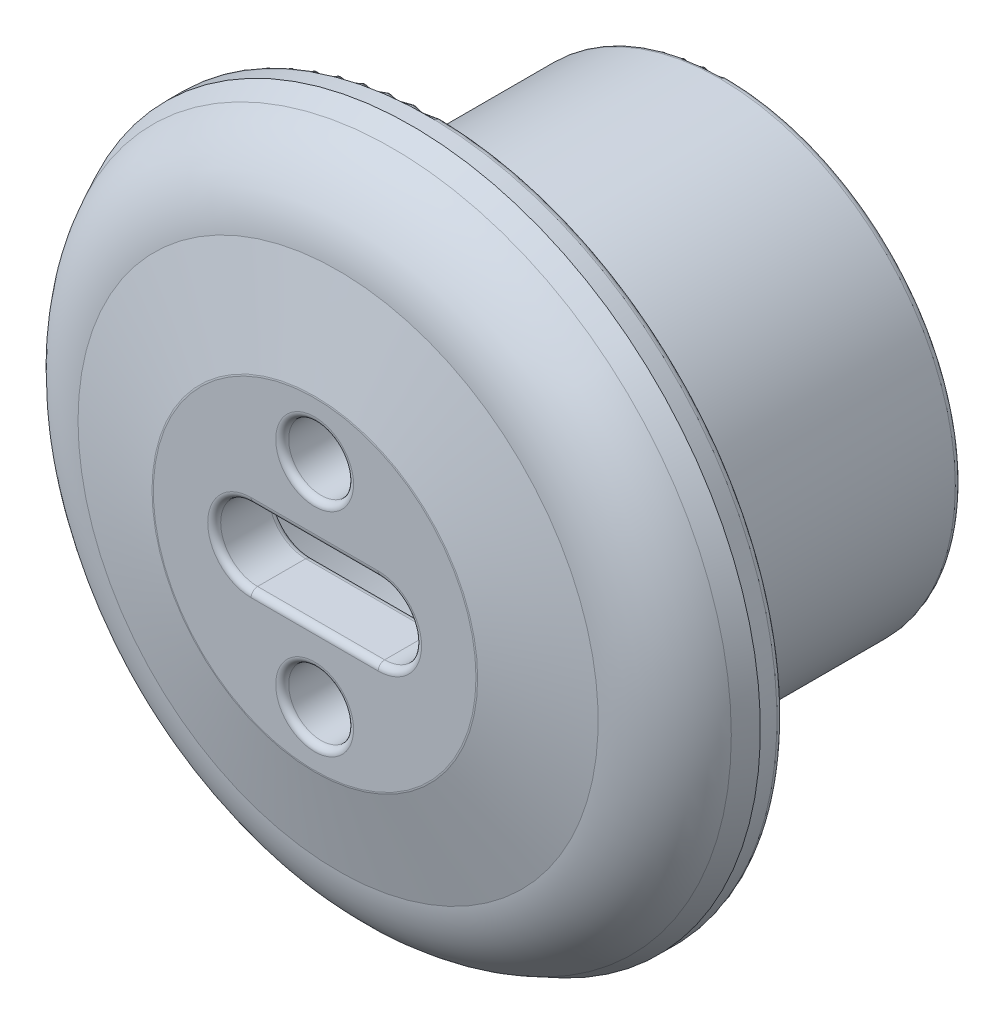
ISO-10303-21;
HEADER;
FILE_DESCRIPTION(('STEP AP214'),'2;1');
FILE_NAME('part.step','',(''),(''),'','','');
FILE_SCHEMA(('AUTOMOTIVE_DESIGN { 1 0 10303 214 1 1 1 1 }'));
ENDSEC;
DATA;
#1=APPLICATION_CONTEXT('core data for automotive mechanical design processes');
#2=APPLICATION_PROTOCOL_DEFINITION('international standard','automotive_design',2000,#1);
#3=PRODUCT_CONTEXT('',#1,'mechanical');
#4=PRODUCT('Part','Part','',(#3));
#5=PRODUCT_RELATED_PRODUCT_CATEGORY('part','',(#4));
#6=PRODUCT_DEFINITION_FORMATION('','',#4);
#7=PRODUCT_DEFINITION_CONTEXT('part definition',#1,'design');
#8=PRODUCT_DEFINITION('design','',#6,#7);
#9=PRODUCT_DEFINITION_SHAPE('','',#8);
#10=(LENGTH_UNIT() NAMED_UNIT(*) SI_UNIT(.MILLI.,.METRE.));
#11=(NAMED_UNIT(*) PLANE_ANGLE_UNIT() SI_UNIT($,.RADIAN.));
#12=(NAMED_UNIT(*) SI_UNIT($,.STERADIAN.) SOLID_ANGLE_UNIT());
#13=UNCERTAINTY_MEASURE_WITH_UNIT(LENGTH_MEASURE(1.E-05),#10,'distance_accuracy_value','');
#14=(GEOMETRIC_REPRESENTATION_CONTEXT(3) GLOBAL_UNCERTAINTY_ASSIGNED_CONTEXT((#13)) GLOBAL_UNIT_ASSIGNED_CONTEXT((#10,
#11,#12)) REPRESENTATION_CONTEXT('',''));
#15=CARTESIAN_POINT('',(0.,0.,0.));
#16=DIRECTION('',(0.,0.,1.));
#17=DIRECTION('',(1.,0.,0.));
#18=AXIS2_PLACEMENT_3D('',#15,#16,#17);
#19=CARTESIAN_POINT('',(0.,0.,0.));
#20=DIRECTION('',(0.,0.,1.));
#21=DIRECTION('',(1.,0.,0.));
#22=AXIS2_PLACEMENT_3D('',#19,#20,#21);
#23=PLANE('',#22);
#24=CARTESIAN_POINT('',(0.,0.,0.));
#25=DIRECTION('',(0.,0.,1.));
#26=DIRECTION('',(1.,0.,0.));
#27=AXIS2_PLACEMENT_3D('',#24,#25,#26);
#28=CIRCLE('',#27,4.97638891235121);
#29=CARTESIAN_POINT('',(4.97638891235121,0.,0.));
#30=VERTEX_POINT('',#29);
#31=EDGE_CURVE('E11',#30,#30,#28,.T.);
#32=ORIENTED_EDGE('',*,*,#31,.T.);
#33=EDGE_LOOP('',(#32));
#34=FACE_BOUND('',#33,.T.);
#35=CARTESIAN_POINT('',(1.95955224461386,0.,0.));
#36=DIRECTION('',(0.,0.,1.));
#37=DIRECTION('',(1.,0.,0.));
#38=AXIS2_PLACEMENT_3D('',#35,#36,#37);
#39=CIRCLE('',#38,1.33824518055594);
#40=CARTESIAN_POINT('',(1.95955224461386,1.33824518055594,0.));
#41=VERTEX_POINT('',#40);
#42=CARTESIAN_POINT('',(1.95955224461386,-1.33824518055594,0.));
#43=VERTEX_POINT('',#42);
#44=EDGE_CURVE('E57',#41,#43,#39,.F.);
#45=ORIENTED_EDGE('',*,*,#44,.T.);
#46=DIRECTION('',(1.,0.,0.));
#47=VECTOR('',#46,1.);
#48=CARTESIAN_POINT('',(-1.95955224461386,-1.33824518055594,0.));
#49=LINE('',#48,#47);
#50=CARTESIAN_POINT('',(-1.95955224461386,-1.33824518055594,0.));
#51=VERTEX_POINT('',#50);
#52=EDGE_CURVE('E49',#43,#51,#49,.F.);
#53=ORIENTED_EDGE('',*,*,#52,.T.);
#54=CARTESIAN_POINT('',(-1.95955224461386,0.,0.));
#55=DIRECTION('',(0.,0.,1.));
#56=DIRECTION('',(1.,0.,0.));
#57=AXIS2_PLACEMENT_3D('',#54,#55,#56);
#58=CIRCLE('',#57,1.33824518055594);
#59=CARTESIAN_POINT('',(-1.95955224461386,1.33824518055594,0.));
#60=VERTEX_POINT('',#59);
#61=EDGE_CURVE('E283',#51,#60,#58,.F.);
#62=ORIENTED_EDGE('',*,*,#61,.T.);
#63=DIRECTION('',(-1.,0.,0.));
#64=VECTOR('',#63,1.);
#65=CARTESIAN_POINT('',(1.95955224461386,1.33824518055594,0.));
#66=LINE('',#65,#64);
#67=EDGE_CURVE('E62',#60,#41,#66,.F.);
#68=ORIENTED_EDGE('',*,*,#67,.T.);
#69=EDGE_LOOP('',(#45,#53,#62,#68));
#70=FACE_BOUND('',#69,.T.);
#71=CARTESIAN_POINT('',(0.,3.27442446554471,0.));
#72=DIRECTION('',(0.,0.,1.));
#73=DIRECTION('',(1.,0.,0.));
#74=AXIS2_PLACEMENT_3D('',#71,#72,#73);
#75=CIRCLE('',#74,1.2);
#76=CARTESIAN_POINT('',(1.2,3.27442446554471,0.));
#77=VERTEX_POINT('',#76);
#78=EDGE_CURVE('E279',#77,#77,#75,.F.);
#79=ORIENTED_EDGE('',*,*,#78,.T.);
#80=EDGE_LOOP('',(#79));
#81=FACE_BOUND('',#80,.T.);
#82=CARTESIAN_POINT('',(0.,-3.27442446554471,0.));
#83=DIRECTION('',(0.,0.,1.));
#84=DIRECTION('',(1.,0.,0.));
#85=AXIS2_PLACEMENT_3D('',#82,#83,#84);
#86=CIRCLE('',#85,1.2);
#87=CARTESIAN_POINT('',(1.2,-3.27442446554471,0.));
#88=VERTEX_POINT('',#87);
#89=EDGE_CURVE('E275',#88,#88,#86,.F.);
#90=ORIENTED_EDGE('',*,*,#89,.T.);
#91=EDGE_LOOP('',(#90));
#92=FACE_BOUND('',#91,.T.);
#93=ADVANCED_FACE('F39',(#34,#70,#81,#92),#23,.T.);
#94=CARTESIAN_POINT('',(0.,0.,-0.723761069473712));
#95=DIRECTION('',(0.,0.,-1.));
#96=DIRECTION('',(-1.,0.,0.));
#97=AXIS2_PLACEMENT_3D('',#94,#95,#96);
#98=CONICAL_SURFACE('',#97,8.02262208103095,1.33577326733021);
#99=CARTESIAN_POINT('',(0.,0.,-0.00549820563210427));
#100=DIRECTION('',(0.,0.,1.));
#101=DIRECTION('',(1.,0.,0.));
#102=AXIS2_PLACEMENT_3D('',#99,#100,#101);
#103=CIRCLE('',#102,5.02296199457334);
#104=CARTESIAN_POINT('',(5.02296199457334,0.,-0.00549820563210427));
#105=VERTEX_POINT('',#104);
#106=EDGE_CURVE('E271',#105,#105,#103,.F.);
#107=ORIENTED_EDGE('',*,*,#106,.T.);
#108=EDGE_LOOP('',(#107));
#109=FACE_BOUND('',#108,.T.);
#110=CARTESIAN_POINT('',(0.,0.,-0.723761069473712));
#111=DIRECTION('',(0.,0.,-1.));
#112=DIRECTION('',(-1.,0.,0.));
#113=AXIS2_PLACEMENT_3D('',#110,#111,#112);
#114=CIRCLE('',#113,8.02262208103095);
#115=CARTESIAN_POINT('',(-8.02262208103095,0.,-0.723761069473712));
#116=VERTEX_POINT('',#115);
#117=EDGE_CURVE('E185',#116,#116,#114,.T.);
#118=ORIENTED_EDGE('',*,*,#117,.F.);
#119=EDGE_LOOP('',(#118));
#120=FACE_BOUND('',#119,.T.);
#121=ADVANCED_FACE('F325',(#109,#120),#98,.T.);
#122=CARTESIAN_POINT('',(0.,0.,-3.7122066964541));
#123=DIRECTION('',(0.,0.,-1.));
#124=DIRECTION('',(-1.,0.,0.));
#125=AXIS2_PLACEMENT_3D('',#122,#123,#124);
#126=TOROIDAL_SURFACE('',#125,7.7595769621221,3.);
#127=ORIENTED_EDGE('',*,*,#117,.T.);
#128=EDGE_LOOP('',(#127));
#129=FACE_BOUND('',#128,.T.);
#130=CARTESIAN_POINT('',(0.,0.,-2.39715239491272));
#131=DIRECTION('',(0.,0.,-1.));
#132=DIRECTION('',(-1.,0.,0.));
#133=AXIS2_PLACEMENT_3D('',#130,#131,#132);
#134=CIRCLE('',#133,10.4559879441494);
#135=CARTESIAN_POINT('',(-10.4559879441494,0.,-2.39715239491272));
#136=VERTEX_POINT('',#135);
#137=EDGE_CURVE('E181',#136,#136,#134,.T.);
#138=ORIENTED_EDGE('',*,*,#137,.F.);
#139=EDGE_LOOP('',(#138));
#140=FACE_BOUND('',#139,.T.);
#141=ADVANCED_FACE('F406',(#129,#140),#126,.T.);
#142=CARTESIAN_POINT('',(0.,0.,-3.));
#143=DIRECTION('',(0.,0.,-1.));
#144=DIRECTION('',(-1.,0.,0.));
#145=AXIS2_PLACEMENT_3D('',#142,#143,#144);
#146=CONICAL_SURFACE('',#145,10.75,0.453763672978369);
#147=ORIENTED_EDGE('',*,*,#137,.T.);
#148=EDGE_LOOP('',(#147));
#149=FACE_BOUND('',#148,.T.);
#150=CARTESIAN_POINT('',(0.,0.,-3.));
#151=DIRECTION('',(0.,0.,-1.));
#152=DIRECTION('',(-1.,0.,0.));
#153=AXIS2_PLACEMENT_3D('',#150,#151,#152);
#154=CIRCLE('',#153,10.75);
#155=CARTESIAN_POINT('',(-10.75,0.,-3.));
#156=VERTEX_POINT('',#155);
#157=EDGE_CURVE('E177',#156,#156,#154,.T.);
#158=ORIENTED_EDGE('',*,*,#157,.F.);
#159=EDGE_LOOP('',(#158));
#160=FACE_BOUND('',#159,.T.);
#161=ADVANCED_FACE('F402',(#149,#160),#146,.T.);
#162=CARTESIAN_POINT('',(0.,0.,-1.88250995795869));
#163=DIRECTION('',(0.,0.,-1.));
#164=DIRECTION('',(-1.,0.,0.));
#165=AXIS2_PLACEMENT_3D('',#162,#163,#164);
#166=CYLINDRICAL_SURFACE('',#165,10.75);
#167=CARTESIAN_POINT('',(0.,0.,-3.5122066964541));
#168=DIRECTION('',(0.,0.,-1.));
#169=DIRECTION('',(-1.,0.,0.));
#170=AXIS2_PLACEMENT_3D('',#167,#168,#169);
#171=CIRCLE('',#170,10.75);
#172=CARTESIAN_POINT('',(-10.75,0.,-3.5122066964541));
#173=VERTEX_POINT('',#172);
#174=EDGE_CURVE('E205',#173,#173,#171,.F.);
#175=ORIENTED_EDGE('',*,*,#174,.T.);
#176=EDGE_LOOP('',(#175));
#177=FACE_BOUND('',#176,.T.);
#178=ORIENTED_EDGE('',*,*,#157,.T.);
#179=EDGE_LOOP('',(#178));
#180=FACE_BOUND('',#179,.T.);
#181=ADVANCED_FACE('F398',(#177,#180),#166,.T.);
#182=CARTESIAN_POINT('',(0.,10.75,-3.7122066964541));
#183=DIRECTION('',(0.,0.,-1.));
#184=DIRECTION('',(-1.,0.,0.));
#185=AXIS2_PLACEMENT_3D('',#182,#183,#184);
#186=PLANE('',#185);
#187=CARTESIAN_POINT('',(0.,0.,-3.7122066964541));
#188=DIRECTION('',(0.,0.,-1.));
#189=DIRECTION('',(-1.,0.,0.));
#190=AXIS2_PLACEMENT_3D('',#187,#188,#189);
#191=CIRCLE('',#190,10.55);
#192=CARTESIAN_POINT('',(-10.55,0.,-3.7122066964541));
#193=VERTEX_POINT('',#192);
#194=EDGE_CURVE('E201',#193,#193,#191,.T.);
#195=ORIENTED_EDGE('',*,*,#194,.T.);
#196=EDGE_LOOP('',(#195));
#197=FACE_BOUND('',#196,.T.);
#198=CARTESIAN_POINT('',(0.,0.,-3.7122066964541));
#199=DIRECTION('',(0.,0.,-1.));
#200=DIRECTION('',(-1.,0.,0.));
#201=AXIS2_PLACEMENT_3D('',#198,#199,#200);
#202=CIRCLE('',#201,8.75);
#203=CARTESIAN_POINT('',(-8.75,0.,-3.7122066964541));
#204=VERTEX_POINT('',#203);
#205=EDGE_CURVE('E173',#204,#204,#202,.T.);
#206=ORIENTED_EDGE('',*,*,#205,.F.);
#207=EDGE_LOOP('',(#206));
#208=FACE_BOUND('',#207,.T.);
#209=ADVANCED_FACE('F394',(#197,#208),#186,.T.);
#210=CARTESIAN_POINT('',(0.,0.,-1.88250995795869));
#211=DIRECTION('',(0.,0.,-1.));
#212=DIRECTION('',(-1.,0.,0.));
#213=AXIS2_PLACEMENT_3D('',#210,#211,#212);
#214=CYLINDRICAL_SURFACE('',#213,8.75);
#215=CARTESIAN_POINT('',(0.,0.,-4.5122066964541));
#216=DIRECTION('',(0.,0.,-1.));
#217=DIRECTION('',(-1.,0.,0.));
#218=AXIS2_PLACEMENT_3D('',#215,#216,#217);
#219=CIRCLE('',#218,8.75);
#220=CARTESIAN_POINT('',(-8.75,0.,-4.5122066964541));
#221=VERTEX_POINT('',#220);
#222=EDGE_CURVE('E213',#221,#221,#219,.F.);
#223=ORIENTED_EDGE('',*,*,#222,.T.);
#224=EDGE_LOOP('',(#223));
#225=FACE_BOUND('',#224,.T.);
#226=ORIENTED_EDGE('',*,*,#205,.T.);
#227=EDGE_LOOP('',(#226));
#228=FACE_BOUND('',#227,.T.);
#229=ADVANCED_FACE('F390',(#225,#228),#214,.T.);
#230=CARTESIAN_POINT('',(0.,8.75,-4.7122066964541));
#231=DIRECTION('',(0.,0.,-1.));
#232=DIRECTION('',(-1.,0.,0.));
#233=AXIS2_PLACEMENT_3D('',#230,#231,#232);
#234=PLANE('',#233);
#235=CARTESIAN_POINT('',(0.,0.,-4.7122066964541));
#236=DIRECTION('',(0.,0.,-1.));
#237=DIRECTION('',(-1.,0.,0.));
#238=AXIS2_PLACEMENT_3D('',#235,#236,#237);
#239=CIRCLE('',#238,8.55);
#240=CARTESIAN_POINT('',(-8.55,0.,-4.7122066964541));
#241=VERTEX_POINT('',#240);
#242=EDGE_CURVE('E209',#241,#241,#239,.T.);
#243=ORIENTED_EDGE('',*,*,#242,.T.);
#244=EDGE_LOOP('',(#243));
#245=FACE_BOUND('',#244,.T.);
#246=CARTESIAN_POINT('',(0.,0.,-4.7122066964541));
#247=DIRECTION('',(0.,0.,-1.));
#248=DIRECTION('',(-1.,0.,0.));
#249=AXIS2_PLACEMENT_3D('',#246,#247,#248);
#250=CIRCLE('',#249,7.25);
#251=CARTESIAN_POINT('',(-7.25,0.,-4.7122066964541));
#252=VERTEX_POINT('',#251);
#253=EDGE_CURVE('E169',#252,#252,#250,.T.);
#254=ORIENTED_EDGE('',*,*,#253,.F.);
#255=EDGE_LOOP('',(#254));
#256=FACE_BOUND('',#255,.T.);
#257=ADVANCED_FACE('F386',(#245,#256),#234,.T.);
#258=CARTESIAN_POINT('',(0.,0.,-1.88250995795869));
#259=DIRECTION('',(0.,0.,-1.));
#260=DIRECTION('',(-1.,0.,0.));
#261=AXIS2_PLACEMENT_3D('',#258,#259,#260);
#262=CYLINDRICAL_SURFACE('',#261,7.25);
#263=CARTESIAN_POINT('',(0.,0.,-12.5122066964541));
#264=DIRECTION('',(0.,0.,-1.));
#265=DIRECTION('',(-1.,0.,0.));
#266=AXIS2_PLACEMENT_3D('',#263,#264,#265);
#267=CIRCLE('',#266,7.25);
#268=CARTESIAN_POINT('',(-7.25,0.,-12.5122066964541));
#269=VERTEX_POINT('',#268);
#270=EDGE_CURVE('E217',#269,#269,#267,.F.);
#271=ORIENTED_EDGE('',*,*,#270,.T.);
#272=EDGE_LOOP('',(#271));
#273=FACE_BOUND('',#272,.T.);
#274=ORIENTED_EDGE('',*,*,#253,.T.);
#275=EDGE_LOOP('',(#274));
#276=FACE_BOUND('',#275,.T.);
#277=ADVANCED_FACE('F382',(#273,#276),#262,.T.);
#278=CARTESIAN_POINT('',(0.,7.25,-12.7122066964541));
#279=DIRECTION('',(0.,0.,-1.));
#280=DIRECTION('',(-1.,0.,0.));
#281=AXIS2_PLACEMENT_3D('',#278,#279,#280);
#282=PLANE('',#281);
#283=CARTESIAN_POINT('',(0.,0.,-12.7122066964541));
#284=DIRECTION('',(0.,0.,-1.));
#285=DIRECTION('',(-1.,0.,0.));
#286=AXIS2_PLACEMENT_3D('',#283,#284,#285);
#287=CIRCLE('',#286,6.45);
#288=CARTESIAN_POINT('',(-6.45,0.,-12.7122066964541));
#289=VERTEX_POINT('',#288);
#290=EDGE_CURVE('E197',#289,#289,#287,.F.);
#291=ORIENTED_EDGE('',*,*,#290,.T.);
#292=EDGE_LOOP('',(#291));
#293=FACE_BOUND('',#292,.T.);
#294=CARTESIAN_POINT('',(0.,0.,-12.7122066964541));
#295=DIRECTION('',(0.,0.,-1.));
#296=DIRECTION('',(-1.,0.,0.));
#297=AXIS2_PLACEMENT_3D('',#294,#295,#296);
#298=CIRCLE('',#297,7.05);
#299=CARTESIAN_POINT('',(-7.05,0.,-12.7122066964541));
#300=VERTEX_POINT('',#299);
#301=EDGE_CURVE('E193',#300,#300,#298,.T.);
#302=ORIENTED_EDGE('',*,*,#301,.T.);
#303=EDGE_LOOP('',(#302));
#304=FACE_BOUND('',#303,.T.);
#305=ADVANCED_FACE('F378',(#293,#304),#282,.T.);
#306=CARTESIAN_POINT('',(0.,0.,-1.88250995795869));
#307=DIRECTION('',(0.,0.,-1.));
#308=DIRECTION('',(-1.,0.,0.));
#309=AXIS2_PLACEMENT_3D('',#306,#307,#308);
#310=CYLINDRICAL_SURFACE('',#309,6.25);
#311=CARTESIAN_POINT('',(0.,0.,-12.5122066964541));
#312=DIRECTION('',(0.,0.,-1.));
#313=DIRECTION('',(-1.,0.,0.));
#314=AXIS2_PLACEMENT_3D('',#311,#312,#313);
#315=CIRCLE('',#314,6.25);
#316=CARTESIAN_POINT('',(-6.25,0.,-12.5122066964541));
#317=VERTEX_POINT('',#316);
#318=EDGE_CURVE('E189',#317,#317,#315,.T.);
#319=ORIENTED_EDGE('',*,*,#318,.T.);
#320=EDGE_LOOP('',(#319));
#321=FACE_BOUND('',#320,.T.);
#322=CARTESIAN_POINT('',(0.,0.,-2.88250995795869));
#323=DIRECTION('',(0.,0.,-1.));
#324=DIRECTION('',(-1.,0.,0.));
#325=AXIS2_PLACEMENT_3D('',#322,#323,#324);
#326=CIRCLE('',#325,6.25);
#327=CARTESIAN_POINT('',(-6.25,0.,-2.88250995795869));
#328=VERTEX_POINT('',#327);
#329=EDGE_CURVE('E165',#328,#328,#326,.T.);
#330=ORIENTED_EDGE('',*,*,#329,.F.);
#331=EDGE_LOOP('',(#330));
#332=FACE_BOUND('',#331,.T.);
#333=ADVANCED_FACE('F374',(#321,#332),#310,.F.);
#334=CARTESIAN_POINT('',(0.,0.,-2.88250995795869));
#335=DIRECTION('',(0.,0.,-1.));
#336=DIRECTION('',(-1.,0.,0.));
#337=AXIS2_PLACEMENT_3D('',#334,#335,#336);
#338=TOROIDAL_SURFACE('',#337,5.25,1.);
#339=ORIENTED_EDGE('',*,*,#329,.T.);
#340=EDGE_LOOP('',(#339));
#341=FACE_BOUND('',#340,.T.);
#342=CARTESIAN_POINT('',(0.,0.,-1.88250995795869));
#343=DIRECTION('',(0.,0.,-1.));
#344=DIRECTION('',(-1.,0.,0.));
#345=AXIS2_PLACEMENT_3D('',#342,#343,#344);
#346=CIRCLE('',#345,5.25);
#347=CARTESIAN_POINT('',(-5.25,0.,-1.88250995795869));
#348=VERTEX_POINT('',#347);
#349=EDGE_CURVE('E153',#348,#348,#346,.T.);
#350=ORIENTED_EDGE('',*,*,#349,.F.);
#351=EDGE_LOOP('',(#350));
#352=FACE_BOUND('',#351,.T.);
#353=ADVANCED_FACE('F370',(#341,#352),#338,.F.);
#354=CARTESIAN_POINT('',(0.,5.25,-1.88250995795869));
#355=DIRECTION('',(0.,0.,-1.));
#356=DIRECTION('',(-1.,0.,0.));
#357=AXIS2_PLACEMENT_3D('',#354,#355,#356);
#358=PLANE('',#357);
#359=CARTESIAN_POINT('',(1.95955224461386,0.,-1.88250995795869));
#360=DIRECTION('',(0.,0.,-1.));
#361=DIRECTION('',(-1.,0.,0.));
#362=AXIS2_PLACEMENT_3D('',#359,#360,#361);
#363=CIRCLE('',#362,1.33824518055594);
#364=CARTESIAN_POINT('',(1.95955224461386,-1.33824518055594,-1.88250995795869));
#365=VERTEX_POINT('',#364);
#366=CARTESIAN_POINT('',(1.95955224461386,1.33824518055594,-1.88250995795869));
#367=VERTEX_POINT('',#366);
#368=EDGE_CURVE('E236',#365,#367,#363,.F.);
#369=ORIENTED_EDGE('',*,*,#368,.T.);
#370=DIRECTION('',(1.,0.,0.));
#371=VECTOR('',#370,1.);
#372=CARTESIAN_POINT('',(-1.95955224461386,1.33824518055594,-1.88250995795869));
#373=LINE('',#372,#371);
#374=CARTESIAN_POINT('',(-1.95955224461386,1.33824518055594,-1.88250995795869));
#375=VERTEX_POINT('',#374);
#376=EDGE_CURVE('E114',#367,#375,#373,.F.);
#377=ORIENTED_EDGE('',*,*,#376,.T.);
#378=CARTESIAN_POINT('',(-1.95955224461386,0.,-1.88250995795869));
#379=DIRECTION('',(0.,0.,-1.));
#380=DIRECTION('',(-1.,0.,0.));
#381=AXIS2_PLACEMENT_3D('',#378,#379,#380);
#382=CIRCLE('',#381,1.33824518055594);
#383=CARTESIAN_POINT('',(-1.95955224461386,-1.33824518055594,-1.88250995795869));
#384=VERTEX_POINT('',#383);
#385=EDGE_CURVE('E230',#375,#384,#382,.F.);
#386=ORIENTED_EDGE('',*,*,#385,.T.);
#387=DIRECTION('',(-1.,0.,0.));
#388=VECTOR('',#387,1.);
#389=CARTESIAN_POINT('',(1.95955224461386,-1.33824518055594,-1.88250995795869));
#390=LINE('',#389,#388);
#391=EDGE_CURVE('E233',#384,#365,#390,.F.);
#392=ORIENTED_EDGE('',*,*,#391,.T.);
#393=EDGE_LOOP('',(#369,#377,#386,#392));
#394=FACE_BOUND('',#393,.T.);
#395=CARTESIAN_POINT('',(0.,3.27442446554471,-1.88250995795869));
#396=DIRECTION('',(0.,0.,-1.));
#397=DIRECTION('',(-1.,0.,0.));
#398=AXIS2_PLACEMENT_3D('',#395,#396,#397);
#399=CIRCLE('',#398,1.2);
#400=CARTESIAN_POINT('',(-1.2,3.27442446554471,-1.88250995795869));
#401=VERTEX_POINT('',#400);
#402=EDGE_CURVE('E226',#401,#401,#399,.F.);
#403=ORIENTED_EDGE('',*,*,#402,.T.);
#404=EDGE_LOOP('',(#403));
#405=FACE_BOUND('',#404,.T.);
#406=CARTESIAN_POINT('',(0.,-3.27442446554471,-1.88250995795869));
#407=DIRECTION('',(0.,0.,-1.));
#408=DIRECTION('',(-1.,0.,0.));
#409=AXIS2_PLACEMENT_3D('',#406,#407,#408);
#410=CIRCLE('',#409,1.2);
#411=CARTESIAN_POINT('',(-1.2,-3.27442446554471,-1.88250995795869));
#412=VERTEX_POINT('',#411);
#413=EDGE_CURVE('E143',#412,#412,#410,.F.);
#414=ORIENTED_EDGE('',*,*,#413,.T.);
#415=EDGE_LOOP('',(#414));
#416=FACE_BOUND('',#415,.T.);
#417=ORIENTED_EDGE('',*,*,#349,.T.);
#418=EDGE_LOOP('',(#417));
#419=FACE_BOUND('',#418,.T.);
#420=ADVANCED_FACE('F366',(#394,#405,#416,#419),#358,.T.);
#421=CARTESIAN_POINT('',(0.,0.,-12.5122066964541));
#422=DIRECTION('',(0.,0.,-1.));
#423=DIRECTION('',(-1.,0.,0.));
#424=AXIS2_PLACEMENT_3D('',#421,#422,#423);
#425=TOROIDAL_SURFACE('',#424,6.45,0.2);
#426=ORIENTED_EDGE('',*,*,#290,.F.);
#427=EDGE_LOOP('',(#426));
#428=FACE_BOUND('',#427,.T.);
#429=ORIENTED_EDGE('',*,*,#318,.F.);
#430=EDGE_LOOP('',(#429));
#431=FACE_BOUND('',#430,.T.);
#432=ADVANCED_FACE('F369',(#428,#431),#425,.T.);
#433=CARTESIAN_POINT('',(0.,0.,-3.5122066964541));
#434=DIRECTION('',(0.,0.,-1.));
#435=DIRECTION('',(-1.,0.,0.));
#436=AXIS2_PLACEMENT_3D('',#433,#434,#435);
#437=TOROIDAL_SURFACE('',#436,10.55,0.2);
#438=ORIENTED_EDGE('',*,*,#174,.F.);
#439=EDGE_LOOP('',(#438));
#440=FACE_BOUND('',#439,.T.);
#441=ORIENTED_EDGE('',*,*,#194,.F.);
#442=EDGE_LOOP('',(#441));
#443=FACE_BOUND('',#442,.T.);
#444=ADVANCED_FACE('F416',(#440,#443),#437,.T.);
#445=CARTESIAN_POINT('',(0.,0.,-4.5122066964541));
#446=DIRECTION('',(0.,0.,-1.));
#447=DIRECTION('',(-1.,0.,0.));
#448=AXIS2_PLACEMENT_3D('',#445,#446,#447);
#449=TOROIDAL_SURFACE('',#448,8.55,0.2);
#450=ORIENTED_EDGE('',*,*,#222,.F.);
#451=EDGE_LOOP('',(#450));
#452=FACE_BOUND('',#451,.T.);
#453=ORIENTED_EDGE('',*,*,#242,.F.);
#454=EDGE_LOOP('',(#453));
#455=FACE_BOUND('',#454,.T.);
#456=ADVANCED_FACE('F420',(#452,#455),#449,.T.);
#457=CARTESIAN_POINT('',(0.,0.,-12.5122066964541));
#458=DIRECTION('',(0.,0.,-1.));
#459=DIRECTION('',(-1.,0.,0.));
#460=AXIS2_PLACEMENT_3D('',#457,#458,#459);
#461=TOROIDAL_SURFACE('',#460,7.05,0.2);
#462=ORIENTED_EDGE('',*,*,#270,.F.);
#463=EDGE_LOOP('',(#462));
#464=FACE_BOUND('',#463,.T.);
#465=ORIENTED_EDGE('',*,*,#301,.F.);
#466=EDGE_LOOP('',(#465));
#467=FACE_BOUND('',#466,.T.);
#468=ADVANCED_FACE('F364',(#464,#467),#461,.T.);
#469=CARTESIAN_POINT('',(-1.95955224461386,0.,-10.));
#470=DIRECTION('',(0.,0.,1.));
#471=DIRECTION('',(1.,0.,0.));
#472=AXIS2_PLACEMENT_3D('',#469,#470,#471);
#473=CYLINDRICAL_SURFACE('',#472,1.13824518055594);
#474=DIRECTION('',(0.,0.,1.));
#475=VECTOR('',#474,1.);
#476=CARTESIAN_POINT('',(-1.95955224461386,-1.13824518055594,-10.));
#477=LINE('',#476,#475);
#478=CARTESIAN_POINT('',(-1.95955224461386,-1.13824518055594,-1.68250995795869));
#479=VERTEX_POINT('',#478);
#480=CARTESIAN_POINT('',(-1.95955224461386,-1.13824518055594,-0.200000000000001));
#481=VERTEX_POINT('',#480);
#482=EDGE_CURVE('E155',#479,#481,#477,.T.);
#483=ORIENTED_EDGE('',*,*,#482,.F.);
#484=CARTESIAN_POINT('',(-1.95955224461386,0.,-1.68250995795869));
#485=DIRECTION('',(0.,0.,-1.));
#486=DIRECTION('',(-1.,0.,0.));
#487=AXIS2_PLACEMENT_3D('',#484,#485,#486);
#488=CIRCLE('',#487,1.13824518055594);
#489=CARTESIAN_POINT('',(-1.95955224461386,1.13824518055594,-1.68250995795869));
#490=VERTEX_POINT('',#489);
#491=EDGE_CURVE('E252',#479,#490,#488,.T.);
#492=ORIENTED_EDGE('',*,*,#491,.T.);
#493=DIRECTION('',(0.,0.,1.));
#494=VECTOR('',#493,1.);
#495=CARTESIAN_POINT('',(-1.95955224461386,1.13824518055594,-10.));
#496=LINE('',#495,#494);
#497=CARTESIAN_POINT('',(-1.95955224461386,1.13824518055594,-0.200000000000001));
#498=VERTEX_POINT('',#497);
#499=EDGE_CURVE('E140',#490,#498,#496,.T.);
#500=ORIENTED_EDGE('',*,*,#499,.T.);
#501=CARTESIAN_POINT('',(-1.95955224461386,0.,-0.200000000000001));
#502=DIRECTION('',(0.,0.,1.));
#503=DIRECTION('',(1.,0.,0.));
#504=AXIS2_PLACEMENT_3D('',#501,#502,#503);
#505=CIRCLE('',#504,1.13824518055594);
#506=EDGE_CURVE('E249',#498,#481,#505,.T.);
#507=ORIENTED_EDGE('',*,*,#506,.T.);
#508=EDGE_LOOP('',(#483,#492,#500,#507));
#509=FACE_BOUND('',#508,.T.);
#510=ADVANCED_FACE('F356',(#509),#473,.F.);
#511=CARTESIAN_POINT('',(-1.95955224461386,1.13824518055594,-10.));
#512=DIRECTION('',(0.,1.,0.));
#513=DIRECTION('',(0.,0.,1.));
#514=AXIS2_PLACEMENT_3D('',#511,#512,#513);
#515=PLANE('',#514);
#516=ORIENTED_EDGE('',*,*,#499,.F.);
#517=DIRECTION('',(1.,0.,0.));
#518=VECTOR('',#517,1.);
#519=CARTESIAN_POINT('',(1.95955224461386,1.13824518055594,-1.68250995795869));
#520=LINE('',#519,#518);
#521=CARTESIAN_POINT('',(1.95955224461386,1.13824518055594,-1.68250995795869));
#522=VERTEX_POINT('',#521);
#523=EDGE_CURVE('E112',#490,#522,#520,.T.);
#524=ORIENTED_EDGE('',*,*,#523,.T.);
#525=DIRECTION('',(0.,0.,1.));
#526=VECTOR('',#525,1.);
#527=CARTESIAN_POINT('',(1.95955224461386,1.13824518055594,-10.));
#528=LINE('',#527,#526);
#529=CARTESIAN_POINT('',(1.95955224461386,1.13824518055594,-0.200000000000001));
#530=VERTEX_POINT('',#529);
#531=EDGE_CURVE('E137',#522,#530,#528,.T.);
#532=ORIENTED_EDGE('',*,*,#531,.T.);
#533=DIRECTION('',(-1.,0.,0.));
#534=VECTOR('',#533,1.);
#535=CARTESIAN_POINT('',(-1.95955224461386,1.13824518055594,-0.200000000000001));
#536=LINE('',#535,#534);
#537=EDGE_CURVE('E144',#530,#498,#536,.T.);
#538=ORIENTED_EDGE('',*,*,#537,.T.);
#539=EDGE_LOOP('',(#516,#524,#532,#538));
#540=FACE_BOUND('',#539,.T.);
#541=ADVANCED_FACE('F136',(#540),#515,.F.);
#542=CARTESIAN_POINT('',(1.95955224461386,0.,-10.));
#543=DIRECTION('',(0.,0.,1.));
#544=DIRECTION('',(1.,0.,0.));
#545=AXIS2_PLACEMENT_3D('',#542,#543,#544);
#546=CYLINDRICAL_SURFACE('',#545,1.13824518055594);
#547=ORIENTED_EDGE('',*,*,#531,.F.);
#548=CARTESIAN_POINT('',(1.95955224461386,0.,-1.68250995795869));
#549=DIRECTION('',(0.,0.,-1.));
#550=DIRECTION('',(-1.,0.,0.));
#551=AXIS2_PLACEMENT_3D('',#548,#549,#550);
#552=CIRCLE('',#551,1.13824518055594);
#553=CARTESIAN_POINT('',(1.95955224461386,-1.13824518055594,-1.68250995795869));
#554=VERTEX_POINT('',#553);
#555=EDGE_CURVE('E121',#522,#554,#552,.T.);
#556=ORIENTED_EDGE('',*,*,#555,.T.);
#557=DIRECTION('',(0.,0.,1.));
#558=VECTOR('',#557,1.);
#559=CARTESIAN_POINT('',(1.95955224461386,-1.13824518055594,-10.));
#560=LINE('',#559,#558);
#561=CARTESIAN_POINT('',(1.95955224461386,-1.13824518055594,-0.200000000000001));
#562=VERTEX_POINT('',#561);
#563=EDGE_CURVE('E149',#554,#562,#560,.T.);
#564=ORIENTED_EDGE('',*,*,#563,.T.);
#565=CARTESIAN_POINT('',(1.95955224461386,0.,-0.200000000000001));
#566=DIRECTION('',(0.,0.,1.));
#567=DIRECTION('',(1.,0.,0.));
#568=AXIS2_PLACEMENT_3D('',#565,#566,#567);
#569=CIRCLE('',#568,1.13824518055594);
#570=EDGE_CURVE('E131',#562,#530,#569,.T.);
#571=ORIENTED_EDGE('',*,*,#570,.T.);
#572=EDGE_LOOP('',(#547,#556,#564,#571));
#573=FACE_BOUND('',#572,.T.);
#574=ADVANCED_FACE('F146',(#573),#546,.F.);
#575=CARTESIAN_POINT('',(-1.95955224461386,-1.13824518055594,-10.));
#576=DIRECTION('',(0.,-1.,0.));
#577=DIRECTION('',(0.,0.,-1.));
#578=AXIS2_PLACEMENT_3D('',#575,#576,#577);
#579=PLANE('',#578);
#580=ORIENTED_EDGE('',*,*,#563,.F.);
#581=DIRECTION('',(-1.,0.,0.));
#582=VECTOR('',#581,1.);
#583=CARTESIAN_POINT('',(-1.95955224461386,-1.13824518055594,-1.68250995795869));
#584=LINE('',#583,#582);
#585=EDGE_CURVE('E246',#554,#479,#584,.T.);
#586=ORIENTED_EDGE('',*,*,#585,.T.);
#587=ORIENTED_EDGE('',*,*,#482,.T.);
#588=DIRECTION('',(1.,0.,0.));
#589=VECTOR('',#588,1.);
#590=CARTESIAN_POINT('',(1.95955224461386,-1.13824518055594,-0.200000000000001));
#591=LINE('',#590,#589);
#592=EDGE_CURVE('E130',#481,#562,#591,.T.);
#593=ORIENTED_EDGE('',*,*,#592,.T.);
#594=EDGE_LOOP('',(#580,#586,#587,#593));
#595=FACE_BOUND('',#594,.T.);
#596=ADVANCED_FACE('F350',(#595),#579,.F.);
#597=CARTESIAN_POINT('',(0.,3.27442446554471,-10.));
#598=DIRECTION('',(0.,0.,1.));
#599=DIRECTION('',(1.,0.,0.));
#600=AXIS2_PLACEMENT_3D('',#597,#598,#599);
#601=CYLINDRICAL_SURFACE('',#600,1.);
#602=CARTESIAN_POINT('',(0.,3.27442446554471,-1.68250995795869));
#603=DIRECTION('',(0.,0.,-1.));
#604=DIRECTION('',(-1.,0.,0.));
#605=AXIS2_PLACEMENT_3D('',#602,#603,#604);
#606=CIRCLE('',#605,1.);
#607=CARTESIAN_POINT('',(-1.,3.27442446554471,-1.68250995795869));
#608=VERTEX_POINT('',#607);
#609=EDGE_CURVE('E259',#608,#608,#606,.T.);
#610=ORIENTED_EDGE('',*,*,#609,.T.);
#611=EDGE_LOOP('',(#610));
#612=FACE_BOUND('',#611,.T.);
#613=CARTESIAN_POINT('',(0.,3.27442446554471,-0.200000000000001));
#614=DIRECTION('',(0.,0.,1.));
#615=DIRECTION('',(1.,0.,0.));
#616=AXIS2_PLACEMENT_3D('',#613,#614,#615);
#617=CIRCLE('',#616,1.);
#618=CARTESIAN_POINT('',(1.,3.27442446554471,-0.200000000000001));
#619=VERTEX_POINT('',#618);
#620=EDGE_CURVE('E255',#619,#619,#617,.T.);
#621=ORIENTED_EDGE('',*,*,#620,.T.);
#622=EDGE_LOOP('',(#621));
#623=FACE_BOUND('',#622,.T.);
#624=ADVANCED_FACE('F340',(#612,#623),#601,.F.);
#625=CARTESIAN_POINT('',(0.,-3.27442446554471,-10.));
#626=DIRECTION('',(0.,0.,1.));
#627=DIRECTION('',(1.,0.,0.));
#628=AXIS2_PLACEMENT_3D('',#625,#626,#627);
#629=CYLINDRICAL_SURFACE('',#628,1.);
#630=CARTESIAN_POINT('',(0.,-3.27442446554471,-1.68250995795869));
#631=DIRECTION('',(0.,0.,-1.));
#632=DIRECTION('',(-1.,0.,0.));
#633=AXIS2_PLACEMENT_3D('',#630,#631,#632);
#634=CIRCLE('',#633,1.);
#635=CARTESIAN_POINT('',(-1.,-3.27442446554471,-1.68250995795869));
#636=VERTEX_POINT('',#635);
#637=EDGE_CURVE('E267',#636,#636,#634,.T.);
#638=ORIENTED_EDGE('',*,*,#637,.T.);
#639=EDGE_LOOP('',(#638));
#640=FACE_BOUND('',#639,.T.);
#641=CARTESIAN_POINT('',(0.,-3.27442446554471,-0.200000000000001));
#642=DIRECTION('',(0.,0.,1.));
#643=DIRECTION('',(1.,0.,0.));
#644=AXIS2_PLACEMENT_3D('',#641,#642,#643);
#645=CIRCLE('',#644,1.);
#646=CARTESIAN_POINT('',(1.,-3.27442446554471,-0.200000000000001));
#647=VERTEX_POINT('',#646);
#648=EDGE_CURVE('E263',#647,#647,#645,.T.);
#649=ORIENTED_EDGE('',*,*,#648,.T.);
#650=EDGE_LOOP('',(#649));
#651=FACE_BOUND('',#650,.T.);
#652=ADVANCED_FACE('F337',(#640,#651),#629,.F.);
#653=CARTESIAN_POINT('',(-1.95955224461386,-1.33824518055594,-1.68250995795869));
#654=DIRECTION('',(1.,0.,0.));
#655=DIRECTION('',(0.,0.,-1.));
#656=AXIS2_PLACEMENT_3D('',#653,#654,#655);
#657=CYLINDRICAL_SURFACE('',#656,0.2);
#658=CARTESIAN_POINT('',(1.95955224461386,-1.33824518055594,-1.68250995795869));
#659=DIRECTION('',(1.,0.,0.));
#660=DIRECTION('',(0.,0.,-1.));
#661=AXIS2_PLACEMENT_3D('',#658,#659,#660);
#662=CIRCLE('',#661,0.2);
#663=EDGE_CURVE('E124',#365,#554,#662,.T.);
#664=ORIENTED_EDGE('',*,*,#663,.F.);
#665=ORIENTED_EDGE('',*,*,#391,.F.);
#666=CARTESIAN_POINT('',(-1.95955224461386,-1.33824518055594,-1.68250995795869));
#667=DIRECTION('',(-1.,0.,0.));
#668=DIRECTION('',(0.,0.,1.));
#669=AXIS2_PLACEMENT_3D('',#666,#667,#668);
#670=CIRCLE('',#669,0.2);
#671=EDGE_CURVE('E161',#479,#384,#670,.T.);
#672=ORIENTED_EDGE('',*,*,#671,.F.);
#673=ORIENTED_EDGE('',*,*,#585,.F.);
#674=EDGE_LOOP('',(#664,#665,#672,#673));
#675=FACE_BOUND('',#674,.T.);
#676=ADVANCED_FACE('F339',(#675),#657,.T.);
#677=CARTESIAN_POINT('',(-1.95955224461386,0.,-1.68250995795869));
#678=DIRECTION('',(0.,0.,-1.));
#679=DIRECTION('',(-1.,0.,0.));
#680=AXIS2_PLACEMENT_3D('',#677,#678,#679);
#681=TOROIDAL_SURFACE('',#680,1.33824518055594,0.2);
#682=ORIENTED_EDGE('',*,*,#671,.T.);
#683=ORIENTED_EDGE('',*,*,#385,.F.);
#684=CARTESIAN_POINT('',(-1.95955224461386,1.33824518055594,-1.68250995795869));
#685=DIRECTION('',(1.,0.,0.));
#686=DIRECTION('',(0.,0.,-1.));
#687=AXIS2_PLACEMENT_3D('',#684,#685,#686);
#688=CIRCLE('',#687,0.2);
#689=EDGE_CURVE('E118',#490,#375,#688,.T.);
#690=ORIENTED_EDGE('',*,*,#689,.F.);
#691=ORIENTED_EDGE('',*,*,#491,.F.);
#692=EDGE_LOOP('',(#682,#683,#690,#691));
#693=FACE_BOUND('',#692,.T.);
#694=ADVANCED_FACE('F347',(#693),#681,.T.);
#695=CARTESIAN_POINT('',(1.95955224461386,0.,-1.68250995795869));
#696=DIRECTION('',(0.,0.,-1.));
#697=DIRECTION('',(-1.,0.,0.));
#698=AXIS2_PLACEMENT_3D('',#695,#696,#697);
#699=TOROIDAL_SURFACE('',#698,1.33824518055594,0.2);
#700=ORIENTED_EDGE('',*,*,#663,.T.);
#701=ORIENTED_EDGE('',*,*,#555,.F.);
#702=CARTESIAN_POINT('',(1.95955224461386,1.33824518055594,-1.68250995795869));
#703=DIRECTION('',(-1.,0.,0.));
#704=DIRECTION('',(0.,0.,1.));
#705=AXIS2_PLACEMENT_3D('',#702,#703,#704);
#706=CIRCLE('',#705,0.2);
#707=EDGE_CURVE('E108',#367,#522,#706,.T.);
#708=ORIENTED_EDGE('',*,*,#707,.F.);
#709=ORIENTED_EDGE('',*,*,#368,.F.);
#710=EDGE_LOOP('',(#700,#701,#708,#709));
#711=FACE_BOUND('',#710,.T.);
#712=ADVANCED_FACE('F122',(#711),#699,.T.);
#713=CARTESIAN_POINT('',(-1.95955224461386,1.33824518055594,-1.68250995795869));
#714=DIRECTION('',(-1.,0.,0.));
#715=DIRECTION('',(0.,0.,1.));
#716=AXIS2_PLACEMENT_3D('',#713,#714,#715);
#717=CYLINDRICAL_SURFACE('',#716,0.2);
#718=ORIENTED_EDGE('',*,*,#689,.T.);
#719=ORIENTED_EDGE('',*,*,#376,.F.);
#720=ORIENTED_EDGE('',*,*,#707,.T.);
#721=ORIENTED_EDGE('',*,*,#523,.F.);
#722=EDGE_LOOP('',(#718,#719,#720,#721));
#723=FACE_BOUND('',#722,.T.);
#724=ADVANCED_FACE('F110',(#723),#717,.T.);
#725=CARTESIAN_POINT('',(0.,3.27442446554471,-1.68250995795869));
#726=DIRECTION('',(0.,0.,-1.));
#727=DIRECTION('',(-1.,0.,0.));
#728=AXIS2_PLACEMENT_3D('',#725,#726,#727);
#729=TOROIDAL_SURFACE('',#728,1.2,0.2);
#730=ORIENTED_EDGE('',*,*,#402,.F.);
#731=EDGE_LOOP('',(#730));
#732=FACE_BOUND('',#731,.T.);
#733=ORIENTED_EDGE('',*,*,#609,.F.);
#734=EDGE_LOOP('',(#733));
#735=FACE_BOUND('',#734,.T.);
#736=ADVANCED_FACE('F430',(#732,#735),#729,.T.);
#737=CARTESIAN_POINT('',(0.,-3.27442446554471,-1.68250995795869));
#738=DIRECTION('',(0.,0.,-1.));
#739=DIRECTION('',(-1.,0.,0.));
#740=AXIS2_PLACEMENT_3D('',#737,#738,#739);
#741=TOROIDAL_SURFACE('',#740,1.2,0.2);
#742=ORIENTED_EDGE('',*,*,#413,.F.);
#743=EDGE_LOOP('',(#742));
#744=FACE_BOUND('',#743,.T.);
#745=ORIENTED_EDGE('',*,*,#637,.F.);
#746=EDGE_LOOP('',(#745));
#747=FACE_BOUND('',#746,.T.);
#748=ADVANCED_FACE('F438',(#744,#747),#741,.T.);
#749=CARTESIAN_POINT('',(0.,0.,-0.2));
#750=DIRECTION('',(0.,0.,1.));
#751=DIRECTION('',(1.,0.,0.));
#752=AXIS2_PLACEMENT_3D('',#749,#750,#751);
#753=TOROIDAL_SURFACE('',#752,4.97638891235121,0.2);
#754=ORIENTED_EDGE('',*,*,#31,.F.);
#755=EDGE_LOOP('',(#754));
#756=FACE_BOUND('',#755,.T.);
#757=ORIENTED_EDGE('',*,*,#106,.F.);
#758=EDGE_LOOP('',(#757));
#759=FACE_BOUND('',#758,.T.);
#760=ADVANCED_FACE('F442',(#756,#759),#753,.T.);
#761=CARTESIAN_POINT('',(-1.95955224461386,1.33824518055594,-0.200000000000001));
#762=DIRECTION('',(1.,0.,0.));
#763=DIRECTION('',(0.,0.,-1.));
#764=AXIS2_PLACEMENT_3D('',#761,#762,#763);
#765=CYLINDRICAL_SURFACE('',#764,0.2);
#766=CARTESIAN_POINT('',(1.95955224461386,1.33824518055594,-0.2));
#767=DIRECTION('',(1.,0.,0.));
#768=DIRECTION('',(0.,0.,-1.));
#769=AXIS2_PLACEMENT_3D('',#766,#767,#768);
#770=CIRCLE('',#769,0.2);
#771=EDGE_CURVE('E304',#41,#530,#770,.T.);
#772=ORIENTED_EDGE('',*,*,#771,.F.);
#773=ORIENTED_EDGE('',*,*,#67,.F.);
#774=CARTESIAN_POINT('',(-1.95955224461386,1.33824518055594,-0.200000000000001));
#775=DIRECTION('',(-1.,0.,0.));
#776=DIRECTION('',(0.,0.,1.));
#777=AXIS2_PLACEMENT_3D('',#774,#775,#776);
#778=CIRCLE('',#777,0.2);
#779=EDGE_CURVE('E43',#498,#60,#778,.T.);
#780=ORIENTED_EDGE('',*,*,#779,.F.);
#781=ORIENTED_EDGE('',*,*,#537,.F.);
#782=EDGE_LOOP('',(#772,#773,#780,#781));
#783=FACE_BOUND('',#782,.T.);
#784=ADVANCED_FACE('F317',(#783),#765,.T.);
#785=CARTESIAN_POINT('',(-1.95955224461386,0.,-0.200000000000001));
#786=DIRECTION('',(0.,0.,1.));
#787=DIRECTION('',(1.,0.,0.));
#788=AXIS2_PLACEMENT_3D('',#785,#786,#787);
#789=TOROIDAL_SURFACE('',#788,1.33824518055594,0.2);
#790=ORIENTED_EDGE('',*,*,#779,.T.);
#791=ORIENTED_EDGE('',*,*,#61,.F.);
#792=CARTESIAN_POINT('',(-1.95955224461386,-1.33824518055594,-0.200000000000001));
#793=DIRECTION('',(1.,0.,0.));
#794=DIRECTION('',(0.,0.,-1.));
#795=AXIS2_PLACEMENT_3D('',#792,#793,#794);
#796=CIRCLE('',#795,0.2);
#797=EDGE_CURVE('E302',#481,#51,#796,.T.);
#798=ORIENTED_EDGE('',*,*,#797,.F.);
#799=ORIENTED_EDGE('',*,*,#506,.F.);
#800=EDGE_LOOP('',(#790,#791,#798,#799));
#801=FACE_BOUND('',#800,.T.);
#802=ADVANCED_FACE('F314',(#801),#789,.T.);
#803=CARTESIAN_POINT('',(1.95955224461386,0.,-0.200000000000001));
#804=DIRECTION('',(0.,0.,1.));
#805=DIRECTION('',(1.,0.,0.));
#806=AXIS2_PLACEMENT_3D('',#803,#804,#805);
#807=TOROIDAL_SURFACE('',#806,1.33824518055594,0.2);
#808=ORIENTED_EDGE('',*,*,#771,.T.);
#809=ORIENTED_EDGE('',*,*,#570,.F.);
#810=CARTESIAN_POINT('',(1.95955224461386,-1.33824518055594,-0.2));
#811=DIRECTION('',(-1.,0.,0.));
#812=DIRECTION('',(0.,0.,1.));
#813=AXIS2_PLACEMENT_3D('',#810,#811,#812);
#814=CIRCLE('',#813,0.2);
#815=EDGE_CURVE('E299',#43,#562,#814,.T.);
#816=ORIENTED_EDGE('',*,*,#815,.F.);
#817=ORIENTED_EDGE('',*,*,#44,.F.);
#818=EDGE_LOOP('',(#808,#809,#816,#817));
#819=FACE_BOUND('',#818,.T.);
#820=ADVANCED_FACE('F319',(#819),#807,.T.);
#821=CARTESIAN_POINT('',(-1.95955224461386,-1.33824518055594,-0.200000000000001));
#822=DIRECTION('',(-1.,0.,0.));
#823=DIRECTION('',(0.,0.,1.));
#824=AXIS2_PLACEMENT_3D('',#821,#822,#823);
#825=CYLINDRICAL_SURFACE('',#824,0.2);
#826=ORIENTED_EDGE('',*,*,#797,.T.);
#827=ORIENTED_EDGE('',*,*,#52,.F.);
#828=ORIENTED_EDGE('',*,*,#815,.T.);
#829=ORIENTED_EDGE('',*,*,#592,.F.);
#830=EDGE_LOOP('',(#826,#827,#828,#829));
#831=FACE_BOUND('',#830,.T.);
#832=ADVANCED_FACE('F322',(#831),#825,.T.);
#833=CARTESIAN_POINT('',(0.,3.27442446554471,-0.200000000000001));
#834=DIRECTION('',(0.,0.,1.));
#835=DIRECTION('',(1.,0.,0.));
#836=AXIS2_PLACEMENT_3D('',#833,#834,#835);
#837=TOROIDAL_SURFACE('',#836,1.2,0.2);
#838=ORIENTED_EDGE('',*,*,#78,.F.);
#839=EDGE_LOOP('',(#838));
#840=FACE_BOUND('',#839,.T.);
#841=ORIENTED_EDGE('',*,*,#620,.F.);
#842=EDGE_LOOP('',(#841));
#843=FACE_BOUND('',#842,.T.);
#844=ADVANCED_FACE('F334',(#840,#843),#837,.T.);
#845=CARTESIAN_POINT('',(0.,-3.27442446554471,-0.200000000000001));
#846=DIRECTION('',(0.,0.,1.));
#847=DIRECTION('',(1.,0.,0.));
#848=AXIS2_PLACEMENT_3D('',#845,#846,#847);
#849=TOROIDAL_SURFACE('',#848,1.2,0.2);
#850=ORIENTED_EDGE('',*,*,#89,.F.);
#851=EDGE_LOOP('',(#850));
#852=FACE_BOUND('',#851,.T.);
#853=ORIENTED_EDGE('',*,*,#648,.F.);
#854=EDGE_LOOP('',(#853));
#855=FACE_BOUND('',#854,.T.);
#856=ADVANCED_FACE('F41',(#852,#855),#849,.T.);
#857=CLOSED_SHELL('',(#93,#121,#141,#161,#181,#209,#229,#257,#277,#305,#333,#353,#420,#432,#444,
#456,#468,#510,#541,#574,#596,#624,#652,#676,#694,#712,#724,#736,#748,#760,#784,#802,#820,#832,
#844,#856));
#858=MANIFOLD_SOLID_BREP('B2',#857);
#859=ADVANCED_BREP_SHAPE_REPRESENTATION('',(#18,#858),#14);
#860=SHAPE_DEFINITION_REPRESENTATION(#9,#859);
ENDSEC;
END-ISO-10303-21;
